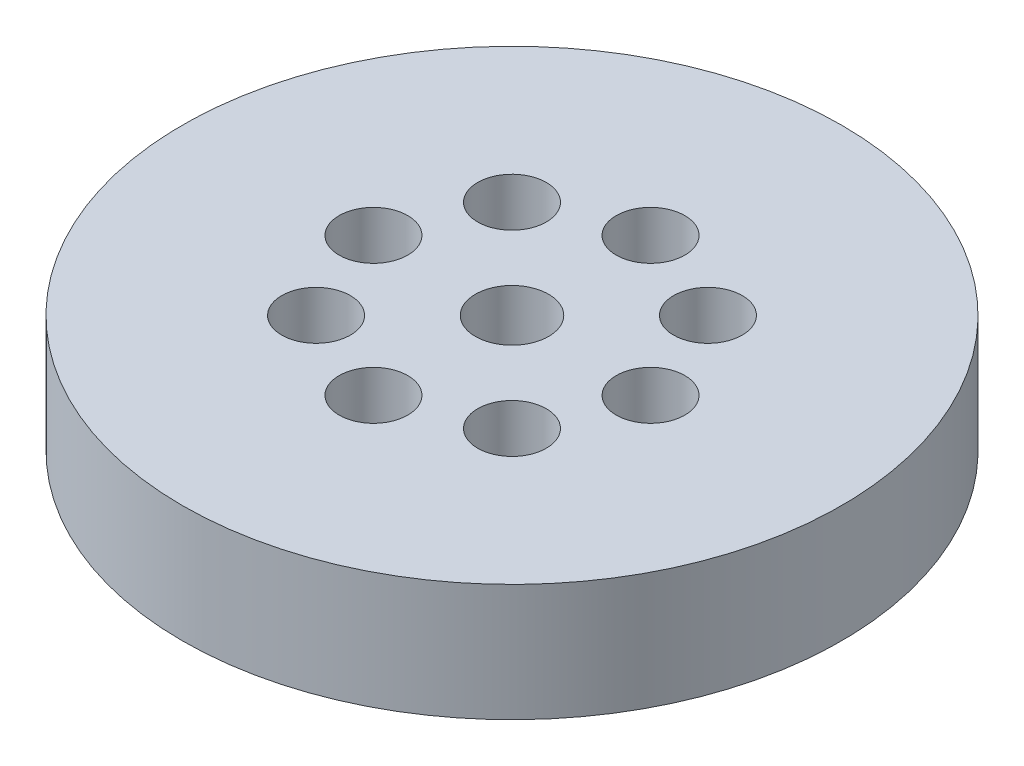
ISO-10303-21;
HEADER;
FILE_DESCRIPTION(('STEP AP214'),'2;1');
FILE_NAME('part.step','',(''),(''),'','','');
FILE_SCHEMA(('AUTOMOTIVE_DESIGN { 1 0 10303 214 1 1 1 1 }'));
ENDSEC;
DATA;
#1=APPLICATION_CONTEXT('core data for automotive mechanical design processes');
#2=APPLICATION_PROTOCOL_DEFINITION('international standard','automotive_design',2000,#1);
#3=PRODUCT_CONTEXT('',#1,'mechanical');
#4=PRODUCT('Part','Part','',(#3));
#5=PRODUCT_RELATED_PRODUCT_CATEGORY('part','',(#4));
#6=PRODUCT_DEFINITION_FORMATION('','',#4);
#7=PRODUCT_DEFINITION_CONTEXT('part definition',#1,'design');
#8=PRODUCT_DEFINITION('design','',#6,#7);
#9=PRODUCT_DEFINITION_SHAPE('','',#8);
#10=(LENGTH_UNIT() NAMED_UNIT(*) SI_UNIT(.MILLI.,.METRE.));
#11=(NAMED_UNIT(*) PLANE_ANGLE_UNIT() SI_UNIT($,.RADIAN.));
#12=(NAMED_UNIT(*) SI_UNIT($,.STERADIAN.) SOLID_ANGLE_UNIT());
#13=UNCERTAINTY_MEASURE_WITH_UNIT(LENGTH_MEASURE(1.E-05),#10,'distance_accuracy_value','');
#14=(GEOMETRIC_REPRESENTATION_CONTEXT(3) GLOBAL_UNCERTAINTY_ASSIGNED_CONTEXT((#13)) GLOBAL_UNIT_ASSIGNED_CONTEXT((#10,
#11,#12)) REPRESENTATION_CONTEXT('',''));
#15=CARTESIAN_POINT('',(0.,0.,0.));
#16=DIRECTION('',(0.,0.,1.));
#17=DIRECTION('',(1.,0.,0.));
#18=AXIS2_PLACEMENT_3D('',#15,#16,#17);
#19=CARTESIAN_POINT('',(0.,16.,0.));
#20=DIRECTION('',(0.,-1.,0.));
#21=DIRECTION('',(0.,0.,-1.));
#22=AXIS2_PLACEMENT_3D('',#19,#20,#21);
#23=CYLINDRICAL_SURFACE('',#22,45.);
#24=CARTESIAN_POINT('',(0.,16.,0.));
#25=DIRECTION('',(0.,1.,0.));
#26=DIRECTION('',(0.,0.,1.));
#27=AXIS2_PLACEMENT_3D('',#24,#25,#26);
#28=CIRCLE('',#27,45.);
#29=CARTESIAN_POINT('',(0.,16.,45.));
#30=VERTEX_POINT('',#29);
#31=EDGE_CURVE('E10',#30,#30,#28,.T.);
#32=ORIENTED_EDGE('',*,*,#31,.F.);
#33=EDGE_LOOP('',(#32));
#34=FACE_BOUND('',#33,.T.);
#35=CARTESIAN_POINT('',(0.,0.,0.));
#36=DIRECTION('',(0.,1.,0.));
#37=DIRECTION('',(0.,0.,1.));
#38=AXIS2_PLACEMENT_3D('',#35,#36,#37);
#39=CIRCLE('',#38,45.);
#40=CARTESIAN_POINT('',(0.,0.,45.));
#41=VERTEX_POINT('',#40);
#42=EDGE_CURVE('E37',#41,#41,#39,.T.);
#43=ORIENTED_EDGE('',*,*,#42,.T.);
#44=EDGE_LOOP('',(#43));
#45=FACE_BOUND('',#44,.T.);
#46=ADVANCED_FACE('F40',(#34,#45),#23,.T.);
#47=CARTESIAN_POINT('',(0.,16.,0.));
#48=DIRECTION('',(0.,1.,0.));
#49=DIRECTION('',(0.,0.,1.));
#50=AXIS2_PLACEMENT_3D('',#47,#48,#49);
#51=PLANE('',#50);
#52=CARTESIAN_POINT('',(0.,16.,18.9185889211163));
#53=DIRECTION('',(0.,1.,0.));
#54=DIRECTION('',(1.,0.,0.));
#55=AXIS2_PLACEMENT_3D('',#52,#53,#54);
#56=CIRCLE('',#55,4.68477627219733);
#57=CARTESIAN_POINT('',(4.68477627219739,16.,18.9185889211163));
#58=VERTEX_POINT('',#57);
#59=EDGE_CURVE('E88',#58,#58,#56,.T.);
#60=ORIENTED_EDGE('',*,*,#59,.F.);
#61=EDGE_LOOP('',(#60));
#62=FACE_BOUND('',#61,.T.);
#63=CARTESIAN_POINT('',(13.3774625166021,16.,13.3774625166019));
#64=DIRECTION('',(0.,1.,0.));
#65=DIRECTION('',(0.707106781186544,0.,-0.707106781186551));
#66=AXIS2_PLACEMENT_3D('',#63,#64,#65);
#67=CIRCLE('',#66,4.68477627219733);
#68=CARTESIAN_POINT('',(16.6900995870146,16.,10.0648254461894));
#69=VERTEX_POINT('',#68);
#70=EDGE_CURVE('E79',#69,#69,#67,.T.);
#71=ORIENTED_EDGE('',*,*,#70,.F.);
#72=EDGE_LOOP('',(#71));
#73=FACE_BOUND('',#72,.T.);
#74=CARTESIAN_POINT('',(18.9185889211163,16.,0.));
#75=DIRECTION('',(0.,1.,0.));
#76=DIRECTION('',(0.,0.,-1.));
#77=AXIS2_PLACEMENT_3D('',#74,#75,#76);
#78=CIRCLE('',#77,4.68477627219733);
#79=CARTESIAN_POINT('',(18.9185889211163,16.,-4.68477627219733));
#80=VERTEX_POINT('',#79);
#81=EDGE_CURVE('E74',#80,#80,#78,.T.);
#82=ORIENTED_EDGE('',*,*,#81,.F.);
#83=EDGE_LOOP('',(#82));
#84=FACE_BOUND('',#83,.T.);
#85=CARTESIAN_POINT('',(13.3774625166019,16.,-13.3774625166021));
#86=DIRECTION('',(0.,1.,0.));
#87=DIRECTION('',(-0.707106781186554,0.,-0.707106781186541));
#88=AXIS2_PLACEMENT_3D('',#85,#86,#87);
#89=CIRCLE('',#88,4.68477627219733);
#90=CARTESIAN_POINT('',(10.0648254461893,16.,-16.6900995870147));
#91=VERTEX_POINT('',#90);
#92=EDGE_CURVE('E70',#91,#91,#89,.T.);
#93=ORIENTED_EDGE('',*,*,#92,.F.);
#94=EDGE_LOOP('',(#93));
#95=FACE_BOUND('',#94,.T.);
#96=CARTESIAN_POINT('',(-1.98161700525966E-13,16.,-18.9185889211163));
#97=DIRECTION('',(0.,1.,0.));
#98=DIRECTION('',(-1.,0.,0.));
#99=AXIS2_PLACEMENT_3D('',#96,#97,#98);
#100=CIRCLE('',#99,4.68477627219733);
#101=CARTESIAN_POINT('',(-4.68477627219753,16.,-18.9185889211162));
#102=VERTEX_POINT('',#101);
#103=EDGE_CURVE('E100',#102,#102,#100,.T.);
#104=ORIENTED_EDGE('',*,*,#103,.F.);
#105=EDGE_LOOP('',(#104));
#106=FACE_BOUND('',#105,.T.);
#107=CARTESIAN_POINT('',(-13.3774625166022,16.,-13.3774625166018));
#108=DIRECTION('',(0.,1.,0.));
#109=DIRECTION('',(-0.707106781186539,0.,0.707106781186556));
#110=AXIS2_PLACEMENT_3D('',#107,#108,#109);
#111=CIRCLE('',#110,4.68477627219733);
#112=CARTESIAN_POINT('',(-16.6900995870147,16.,-10.0648254461892));
#113=VERTEX_POINT('',#112);
#114=EDGE_CURVE('E93',#113,#113,#111,.T.);
#115=ORIENTED_EDGE('',*,*,#114,.F.);
#116=EDGE_LOOP('',(#115));
#117=FACE_BOUND('',#116,.T.);
#118=CARTESIAN_POINT('',(-13.377462516602,16.,13.377462516602));
#119=DIRECTION('',(0.,1.,0.));
#120=DIRECTION('',(0.707106781186549,0.,0.707106781186546));
#121=AXIS2_PLACEMENT_3D('',#118,#119,#120);
#122=CIRCLE('',#121,4.68477627219733);
#123=CARTESIAN_POINT('',(-10.0648254461894,16.,16.6900995870146));
#124=VERTEX_POINT('',#123);
#125=EDGE_CURVE('E61',#124,#124,#122,.T.);
#126=ORIENTED_EDGE('',*,*,#125,.F.);
#127=EDGE_LOOP('',(#126));
#128=FACE_BOUND('',#127,.T.);
#129=CARTESIAN_POINT('',(-18.9185889211163,16.,0.));
#130=DIRECTION('',(0.,1.,0.));
#131=DIRECTION('',(0.,0.,1.));
#132=AXIS2_PLACEMENT_3D('',#129,#130,#131);
#133=CIRCLE('',#132,4.68477627219733);
#134=CARTESIAN_POINT('',(-18.9185889211163,16.,4.68477627219733));
#135=VERTEX_POINT('',#134);
#136=EDGE_CURVE('E54',#135,#135,#133,.T.);
#137=ORIENTED_EDGE('',*,*,#136,.F.);
#138=EDGE_LOOP('',(#137));
#139=FACE_BOUND('',#138,.T.);
#140=CARTESIAN_POINT('',(0.,16.,0.));
#141=DIRECTION('',(0.,1.,0.));
#142=DIRECTION('',(0.,0.,1.));
#143=AXIS2_PLACEMENT_3D('',#140,#141,#142);
#144=CIRCLE('',#143,5.);
#145=CARTESIAN_POINT('',(0.,16.,5.));
#146=VERTEX_POINT('',#145);
#147=EDGE_CURVE('E50',#146,#146,#144,.T.);
#148=ORIENTED_EDGE('',*,*,#147,.F.);
#149=EDGE_LOOP('',(#148));
#150=FACE_BOUND('',#149,.T.);
#151=ORIENTED_EDGE('',*,*,#31,.T.);
#152=EDGE_LOOP('',(#151));
#153=FACE_BOUND('',#152,.T.);
#154=ADVANCED_FACE('F115',(#62,#73,#84,#95,#106,#117,#128,#139,#150,#153),#51,.T.);
#155=CARTESIAN_POINT('',(0.,0.,0.));
#156=DIRECTION('',(0.,1.,0.));
#157=DIRECTION('',(0.,0.,1.));
#158=AXIS2_PLACEMENT_3D('',#155,#156,#157);
#159=PLANE('',#158);
#160=CARTESIAN_POINT('',(0.,0.,0.));
#161=DIRECTION('',(0.,1.,0.));
#162=DIRECTION('',(0.,0.,1.));
#163=AXIS2_PLACEMENT_3D('',#160,#161,#162);
#164=CIRCLE('',#163,5.);
#165=CARTESIAN_POINT('',(0.,0.,5.));
#166=VERTEX_POINT('',#165);
#167=EDGE_CURVE('E47',#166,#166,#164,.T.);
#168=ORIENTED_EDGE('',*,*,#167,.T.);
#169=EDGE_LOOP('',(#168));
#170=FACE_BOUND('',#169,.T.);
#171=ORIENTED_EDGE('',*,*,#42,.F.);
#172=EDGE_LOOP('',(#171));
#173=FACE_BOUND('',#172,.T.);
#174=ADVANCED_FACE('F113',(#170,#173),#159,.F.);
#175=CARTESIAN_POINT('',(0.,16.,0.));
#176=DIRECTION('',(0.,-1.,0.));
#177=DIRECTION('',(0.,0.,-1.));
#178=AXIS2_PLACEMENT_3D('',#175,#176,#177);
#179=CYLINDRICAL_SURFACE('',#178,5.);
#180=ORIENTED_EDGE('',*,*,#147,.T.);
#181=EDGE_LOOP('',(#180));
#182=FACE_BOUND('',#181,.T.);
#183=ORIENTED_EDGE('',*,*,#167,.F.);
#184=EDGE_LOOP('',(#183));
#185=FACE_BOUND('',#184,.T.);
#186=ADVANCED_FACE('F127',(#182,#185),#179,.F.);
#187=CARTESIAN_POINT('',(-18.9185889211163,6.38086457117525,0.));
#188=DIRECTION('',(0.,1.,0.));
#189=DIRECTION('',(0.,0.,1.));
#190=AXIS2_PLACEMENT_3D('',#187,#188,#189);
#191=CYLINDRICAL_SURFACE('',#190,4.68477627219733);
#192=CARTESIAN_POINT('',(-18.9185889211163,6.38086457117525,0.));
#193=DIRECTION('',(0.,1.,0.));
#194=DIRECTION('',(0.,0.,1.));
#195=AXIS2_PLACEMENT_3D('',#192,#193,#194);
#196=CIRCLE('',#195,4.68477627219733);
#197=CARTESIAN_POINT('',(-18.9185889211163,6.38086457117525,4.68477627219733));
#198=VERTEX_POINT('',#197);
#199=EDGE_CURVE('E55',#198,#198,#196,.T.);
#200=ORIENTED_EDGE('',*,*,#199,.F.);
#201=EDGE_LOOP('',(#200));
#202=FACE_BOUND('',#201,.T.);
#203=ORIENTED_EDGE('',*,*,#136,.T.);
#204=EDGE_LOOP('',(#203));
#205=FACE_BOUND('',#204,.T.);
#206=ADVANCED_FACE('F129',(#202,#205),#191,.F.);
#207=CARTESIAN_POINT('',(-18.9185889211163,6.38086457117525,0.));
#208=DIRECTION('',(0.,1.,0.));
#209=DIRECTION('',(0.,0.,1.));
#210=AXIS2_PLACEMENT_3D('',#207,#208,#209);
#211=PLANE('',#210);
#212=ORIENTED_EDGE('',*,*,#199,.T.);
#213=EDGE_LOOP('',(#212));
#214=FACE_BOUND('',#213,.T.);
#215=ADVANCED_FACE('F157',(#214),#211,.T.);
#216=CARTESIAN_POINT('',(-13.377462516602,6.38086457117525,13.377462516602));
#217=DIRECTION('',(0.,1.,0.));
#218=DIRECTION('',(0.,0.,1.));
#219=AXIS2_PLACEMENT_3D('',#216,#217,#218);
#220=CYLINDRICAL_SURFACE('',#219,4.68477627219733);
#221=CARTESIAN_POINT('',(-13.377462516602,6.38086457117525,13.377462516602));
#222=DIRECTION('',(0.,1.,0.));
#223=DIRECTION('',(0.707106781186549,0.,0.707106781186546));
#224=AXIS2_PLACEMENT_3D('',#221,#222,#223);
#225=CIRCLE('',#224,4.68477627219733);
#226=CARTESIAN_POINT('',(-10.0648254461894,6.38086457117525,16.6900995870146));
#227=VERTEX_POINT('',#226);
#228=EDGE_CURVE('E59',#227,#227,#225,.T.);
#229=ORIENTED_EDGE('',*,*,#228,.F.);
#230=EDGE_LOOP('',(#229));
#231=FACE_BOUND('',#230,.T.);
#232=ORIENTED_EDGE('',*,*,#125,.T.);
#233=EDGE_LOOP('',(#232));
#234=FACE_BOUND('',#233,.T.);
#235=ADVANCED_FACE('F170',(#231,#234),#220,.F.);
#236=CARTESIAN_POINT('',(-13.377462516602,6.38086457117525,13.377462516602));
#237=DIRECTION('',(0.,1.,0.));
#238=DIRECTION('',(0.707106781186549,0.,0.707106781186546));
#239=AXIS2_PLACEMENT_3D('',#236,#237,#238);
#240=PLANE('',#239);
#241=ORIENTED_EDGE('',*,*,#228,.T.);
#242=EDGE_LOOP('',(#241));
#243=FACE_BOUND('',#242,.T.);
#244=ADVANCED_FACE('F182',(#243),#240,.T.);
#245=CARTESIAN_POINT('',(-13.3774625166022,6.38086457117525,-13.3774625166018));
#246=DIRECTION('',(0.,1.,0.));
#247=DIRECTION('',(0.,0.,1.));
#248=AXIS2_PLACEMENT_3D('',#245,#246,#247);
#249=CYLINDRICAL_SURFACE('',#248,4.68477627219733);
#250=CARTESIAN_POINT('',(-13.3774625166022,6.38086457117525,-13.3774625166018));
#251=DIRECTION('',(0.,1.,0.));
#252=DIRECTION('',(-0.707106781186539,0.,0.707106781186556));
#253=AXIS2_PLACEMENT_3D('',#250,#251,#252);
#254=CIRCLE('',#253,4.68477627219733);
#255=CARTESIAN_POINT('',(-16.6900995870147,6.38086457117525,-10.0648254461892));
#256=VERTEX_POINT('',#255);
#257=EDGE_CURVE('E94',#256,#256,#254,.T.);
#258=ORIENTED_EDGE('',*,*,#257,.F.);
#259=EDGE_LOOP('',(#258));
#260=FACE_BOUND('',#259,.T.);
#261=ORIENTED_EDGE('',*,*,#114,.T.);
#262=EDGE_LOOP('',(#261));
#263=FACE_BOUND('',#262,.T.);
#264=ADVANCED_FACE('F189',(#260,#263),#249,.F.);
#265=CARTESIAN_POINT('',(-13.3774625166022,6.38086457117525,-13.3774625166018));
#266=DIRECTION('',(0.,1.,0.));
#267=DIRECTION('',(-0.707106781186539,0.,0.707106781186556));
#268=AXIS2_PLACEMENT_3D('',#265,#266,#267);
#269=PLANE('',#268);
#270=ORIENTED_EDGE('',*,*,#257,.T.);
#271=EDGE_LOOP('',(#270));
#272=FACE_BOUND('',#271,.T.);
#273=ADVANCED_FACE('F107',(#272),#269,.T.);
#274=CARTESIAN_POINT('',(-1.98161700525966E-13,6.38086457117525,-18.9185889211163));
#275=DIRECTION('',(0.,1.,0.));
#276=DIRECTION('',(0.,0.,1.));
#277=AXIS2_PLACEMENT_3D('',#274,#275,#276);
#278=CYLINDRICAL_SURFACE('',#277,4.68477627219733);
#279=CARTESIAN_POINT('',(-1.98161700525966E-13,6.38086457117525,-18.9185889211163));
#280=DIRECTION('',(0.,1.,0.));
#281=DIRECTION('',(-1.,0.,0.));
#282=AXIS2_PLACEMENT_3D('',#279,#280,#281);
#283=CIRCLE('',#282,4.68477627219733);
#284=CARTESIAN_POINT('',(-4.68477627219753,6.38086457117525,-18.9185889211162));
#285=VERTEX_POINT('',#284);
#286=EDGE_CURVE('E72',#285,#285,#283,.T.);
#287=ORIENTED_EDGE('',*,*,#286,.F.);
#288=EDGE_LOOP('',(#287));
#289=FACE_BOUND('',#288,.T.);
#290=ORIENTED_EDGE('',*,*,#103,.T.);
#291=EDGE_LOOP('',(#290));
#292=FACE_BOUND('',#291,.T.);
#293=ADVANCED_FACE('F104',(#289,#292),#278,.F.);
#294=CARTESIAN_POINT('',(-1.98161700525966E-13,6.38086457117525,-18.9185889211163));
#295=DIRECTION('',(0.,1.,0.));
#296=DIRECTION('',(-1.,0.,0.));
#297=AXIS2_PLACEMENT_3D('',#294,#295,#296);
#298=PLANE('',#297);
#299=ORIENTED_EDGE('',*,*,#286,.T.);
#300=EDGE_LOOP('',(#299));
#301=FACE_BOUND('',#300,.T.);
#302=ADVANCED_FACE('F103',(#301),#298,.T.);
#303=CARTESIAN_POINT('',(13.3774625166019,6.38086457117525,-13.3774625166021));
#304=DIRECTION('',(0.,1.,0.));
#305=DIRECTION('',(0.,0.,1.));
#306=AXIS2_PLACEMENT_3D('',#303,#304,#305);
#307=CYLINDRICAL_SURFACE('',#306,4.68477627219733);
#308=CARTESIAN_POINT('',(13.3774625166019,6.38086457117525,-13.3774625166021));
#309=DIRECTION('',(0.,1.,0.));
#310=DIRECTION('',(-0.707106781186554,0.,-0.707106781186541));
#311=AXIS2_PLACEMENT_3D('',#308,#309,#310);
#312=CIRCLE('',#311,4.68477627219733);
#313=CARTESIAN_POINT('',(10.0648254461893,6.38086457117525,-16.6900995870147));
#314=VERTEX_POINT('',#313);
#315=EDGE_CURVE('E69',#314,#314,#312,.T.);
#316=ORIENTED_EDGE('',*,*,#315,.F.);
#317=EDGE_LOOP('',(#316));
#318=FACE_BOUND('',#317,.T.);
#319=ORIENTED_EDGE('',*,*,#92,.T.);
#320=EDGE_LOOP('',(#319));
#321=FACE_BOUND('',#320,.T.);
#322=ADVANCED_FACE('F219',(#318,#321),#307,.F.);
#323=CARTESIAN_POINT('',(13.3774625166019,6.38086457117525,-13.3774625166021));
#324=DIRECTION('',(0.,1.,0.));
#325=DIRECTION('',(-0.707106781186554,0.,-0.707106781186541));
#326=AXIS2_PLACEMENT_3D('',#323,#324,#325);
#327=PLANE('',#326);
#328=ORIENTED_EDGE('',*,*,#315,.T.);
#329=EDGE_LOOP('',(#328));
#330=FACE_BOUND('',#329,.T.);
#331=ADVANCED_FACE('F227',(#330),#327,.T.);
#332=CARTESIAN_POINT('',(18.9185889211163,6.38086457117525,0.));
#333=DIRECTION('',(0.,1.,0.));
#334=DIRECTION('',(0.,0.,1.));
#335=AXIS2_PLACEMENT_3D('',#332,#333,#334);
#336=CYLINDRICAL_SURFACE('',#335,4.68477627219733);
#337=CARTESIAN_POINT('',(18.9185889211163,6.38086457117525,0.));
#338=DIRECTION('',(0.,1.,0.));
#339=DIRECTION('',(0.,0.,-1.));
#340=AXIS2_PLACEMENT_3D('',#337,#338,#339);
#341=CIRCLE('',#340,4.68477627219733);
#342=CARTESIAN_POINT('',(18.9185889211163,6.38086457117525,-4.68477627219733));
#343=VERTEX_POINT('',#342);
#344=EDGE_CURVE('E80',#343,#343,#341,.T.);
#345=ORIENTED_EDGE('',*,*,#344,.F.);
#346=EDGE_LOOP('',(#345));
#347=FACE_BOUND('',#346,.T.);
#348=ORIENTED_EDGE('',*,*,#81,.T.);
#349=EDGE_LOOP('',(#348));
#350=FACE_BOUND('',#349,.T.);
#351=ADVANCED_FACE('F240',(#347,#350),#336,.F.);
#352=CARTESIAN_POINT('',(18.9185889211163,6.38086457117525,0.));
#353=DIRECTION('',(0.,1.,0.));
#354=DIRECTION('',(0.,0.,-1.));
#355=AXIS2_PLACEMENT_3D('',#352,#353,#354);
#356=PLANE('',#355);
#357=ORIENTED_EDGE('',*,*,#344,.T.);
#358=EDGE_LOOP('',(#357));
#359=FACE_BOUND('',#358,.T.);
#360=ADVANCED_FACE('F246',(#359),#356,.T.);
#361=CARTESIAN_POINT('',(13.3774625166021,6.38086457117525,13.3774625166019));
#362=DIRECTION('',(0.,1.,0.));
#363=DIRECTION('',(0.,0.,1.));
#364=AXIS2_PLACEMENT_3D('',#361,#362,#363);
#365=CYLINDRICAL_SURFACE('',#364,4.68477627219733);
#366=CARTESIAN_POINT('',(13.3774625166021,6.38086457117525,13.3774625166019));
#367=DIRECTION('',(0.,1.,0.));
#368=DIRECTION('',(0.707106781186544,0.,-0.707106781186551));
#369=AXIS2_PLACEMENT_3D('',#366,#367,#368);
#370=CIRCLE('',#369,4.68477627219733);
#371=CARTESIAN_POINT('',(16.6900995870146,6.38086457117525,10.0648254461894));
#372=VERTEX_POINT('',#371);
#373=EDGE_CURVE('E82',#372,#372,#370,.T.);
#374=ORIENTED_EDGE('',*,*,#373,.F.);
#375=EDGE_LOOP('',(#374));
#376=FACE_BOUND('',#375,.T.);
#377=ORIENTED_EDGE('',*,*,#70,.T.);
#378=EDGE_LOOP('',(#377));
#379=FACE_BOUND('',#378,.T.);
#380=ADVANCED_FACE('F254',(#376,#379),#365,.F.);
#381=CARTESIAN_POINT('',(13.3774625166021,6.38086457117525,13.3774625166019));
#382=DIRECTION('',(0.,1.,0.));
#383=DIRECTION('',(0.707106781186544,0.,-0.707106781186551));
#384=AXIS2_PLACEMENT_3D('',#381,#382,#383);
#385=PLANE('',#384);
#386=ORIENTED_EDGE('',*,*,#373,.T.);
#387=EDGE_LOOP('',(#386));
#388=FACE_BOUND('',#387,.T.);
#389=ADVANCED_FACE('F262',(#388),#385,.T.);
#390=CARTESIAN_POINT('',(0.,6.38086457117525,18.9185889211163));
#391=DIRECTION('',(0.,1.,0.));
#392=DIRECTION('',(0.,0.,1.));
#393=AXIS2_PLACEMENT_3D('',#390,#391,#392);
#394=CYLINDRICAL_SURFACE('',#393,4.68477627219733);
#395=CARTESIAN_POINT('',(0.,6.38086457117525,18.9185889211163));
#396=DIRECTION('',(0.,1.,0.));
#397=DIRECTION('',(1.,0.,0.));
#398=AXIS2_PLACEMENT_3D('',#395,#396,#397);
#399=CIRCLE('',#398,4.68477627219733);
#400=CARTESIAN_POINT('',(4.68477627219739,6.38086457117525,18.9185889211163));
#401=VERTEX_POINT('',#400);
#402=EDGE_CURVE('E63',#401,#401,#399,.T.);
#403=ORIENTED_EDGE('',*,*,#402,.F.);
#404=EDGE_LOOP('',(#403));
#405=FACE_BOUND('',#404,.T.);
#406=ORIENTED_EDGE('',*,*,#59,.T.);
#407=EDGE_LOOP('',(#406));
#408=FACE_BOUND('',#407,.T.);
#409=ADVANCED_FACE('F272',(#405,#408),#394,.F.);
#410=CARTESIAN_POINT('',(0.,6.38086457117525,18.9185889211163));
#411=DIRECTION('',(0.,1.,0.));
#412=DIRECTION('',(1.,0.,0.));
#413=AXIS2_PLACEMENT_3D('',#410,#411,#412);
#414=PLANE('',#413);
#415=ORIENTED_EDGE('',*,*,#402,.T.);
#416=EDGE_LOOP('',(#415));
#417=FACE_BOUND('',#416,.T.);
#418=ADVANCED_FACE('F285',(#417),#414,.T.);
#419=CLOSED_SHELL('',(#46,#154,#174,#186,#206,#215,#235,#244,#264,#273,#293,#302,#322,#331,#351,
#360,#380,#389,#409,#418));
#420=MANIFOLD_SOLID_BREP('B2',#419);
#421=ADVANCED_BREP_SHAPE_REPRESENTATION('',(#18,#420),#14);
#422=SHAPE_DEFINITION_REPRESENTATION(#9,#421);
ENDSEC;
END-ISO-10303-21;
